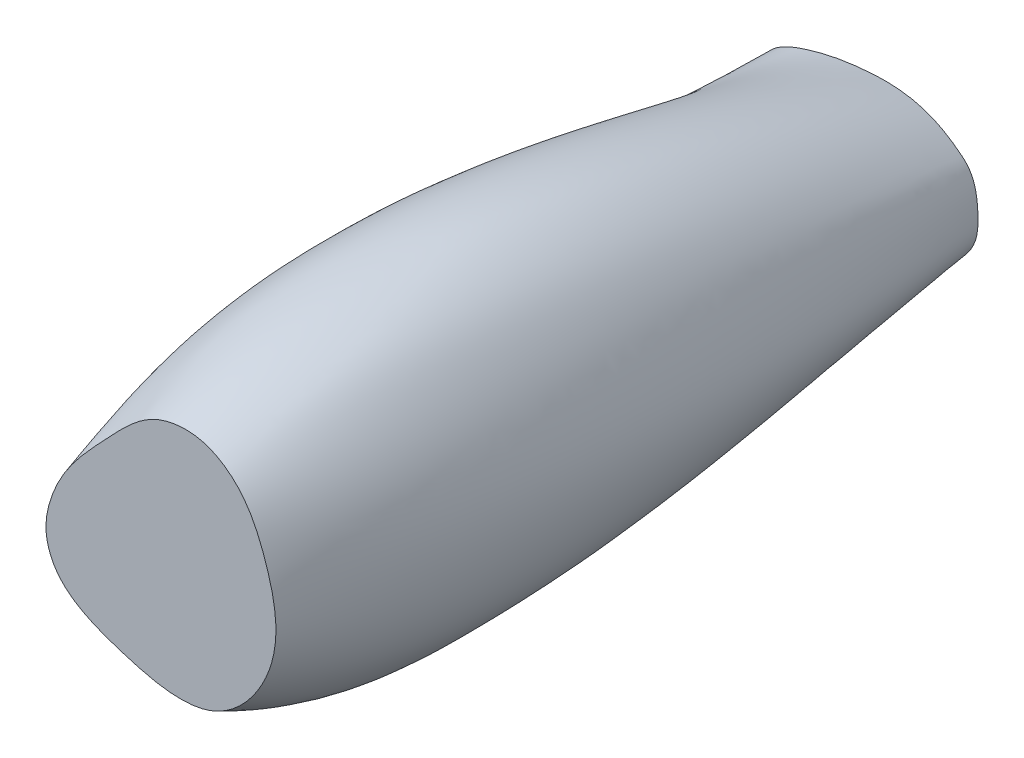
ISO-10303-21;
HEADER;
FILE_DESCRIPTION(('STEP AP214'),'2;1');
FILE_NAME('part.step','',(''),(''),'','','');
FILE_SCHEMA(('AUTOMOTIVE_DESIGN { 1 0 10303 214 1 1 1 1 }'));
ENDSEC;
DATA;
#1=APPLICATION_CONTEXT('core data for automotive mechanical design processes');
#2=APPLICATION_PROTOCOL_DEFINITION('international standard','automotive_design',2000,#1);
#3=PRODUCT_CONTEXT('',#1,'mechanical');
#4=PRODUCT('Part','Part','',(#3));
#5=PRODUCT_RELATED_PRODUCT_CATEGORY('part','',(#4));
#6=PRODUCT_DEFINITION_FORMATION('','',#4);
#7=PRODUCT_DEFINITION_CONTEXT('part definition',#1,'design');
#8=PRODUCT_DEFINITION('design','',#6,#7);
#9=PRODUCT_DEFINITION_SHAPE('','',#8);
#10=(LENGTH_UNIT() NAMED_UNIT(*) SI_UNIT(.MILLI.,.METRE.));
#11=(NAMED_UNIT(*) PLANE_ANGLE_UNIT() SI_UNIT($,.RADIAN.));
#12=(NAMED_UNIT(*) SI_UNIT($,.STERADIAN.) SOLID_ANGLE_UNIT());
#13=UNCERTAINTY_MEASURE_WITH_UNIT(LENGTH_MEASURE(1.E-05),#10,'distance_accuracy_value','');
#14=(GEOMETRIC_REPRESENTATION_CONTEXT(3) GLOBAL_UNCERTAINTY_ASSIGNED_CONTEXT((#13)) GLOBAL_UNIT_ASSIGNED_CONTEXT((#10,
#11,#12)) REPRESENTATION_CONTEXT('',''));
#15=CARTESIAN_POINT('',(0.,0.,0.));
#16=DIRECTION('',(0.,0.,1.));
#17=DIRECTION('',(1.,0.,0.));
#18=AXIS2_PLACEMENT_3D('',#15,#16,#17);
#19=CARTESIAN_POINT('',(-0.588159927287764,-20.8373353458368,-220.));
#20=DIRECTION('',(0.,0.,-1.));
#21=DIRECTION('',(-1.,0.,0.));
#22=AXIS2_PLACEMENT_3D('',#19,#20,#21);
#23=PLANE('',#22);
#24=CARTESIAN_POINT('',(1.49897216730845,23.0872771971501,-220.));
#25=CARTESIAN_POINT('',(-3.15219574899655,22.8190547733143,-220.));
#26=CARTESIAN_POINT('',(-10.9663797197799,21.7891948425807,-220.));
#27=CARTESIAN_POINT('',(-21.9882533955402,18.7077967195995,-220.));
#28=CARTESIAN_POINT('',(-30.8752869264219,14.8899464483007,-220.));
#29=CARTESIAN_POINT('',(-34.8206517873676,6.42814960432633,-220.));
#30=CARTESIAN_POINT('',(-34.1625838646697,-1.90978093792897,-220.));
#31=CARTESIAN_POINT('',(-30.9464178446988,-11.1495820783548,-220.));
#32=CARTESIAN_POINT('',(-25.3643393653193,-17.2308065356574,-220.));
#33=CARTESIAN_POINT('',(-18.3147493423369,-20.3368629306622,-220.));
#34=CARTESIAN_POINT('',(-10.5301895552438,-20.7697819109902,-220.));
#35=CARTESIAN_POINT('',(-0.228182351721812,-20.8621782044685,-220.));
#36=CARTESIAN_POINT('',(9.77284051787086,-20.8237023343144,-220.));
#37=CARTESIAN_POINT('',(19.9820341631392,-20.0812007859628,-220.));
#38=CARTESIAN_POINT('',(28.6962995382988,-15.1573119958422,-220.));
#39=CARTESIAN_POINT('',(34.8498075776385,-6.90526159101365,-220.));
#40=CARTESIAN_POINT('',(35.0718806448064,2.84997327578307,-220.));
#41=CARTESIAN_POINT('',(33.9040750654409,11.4761864353116,-220.));
#42=CARTESIAN_POINT('',(26.9725499998966,17.1396062646687,-220.));
#43=CARTESIAN_POINT('',(19.6354665746085,21.477745015482,-220.));
#44=CARTESIAN_POINT('',(10.1885517817876,23.3362651358272,-220.));
#45=CARTESIAN_POINT('',(4.08564928264427,23.2364450659609,-220.));
#46=CARTESIAN_POINT('',(1.49897216730845,23.0872771971501,-220.));
#47=B_SPLINE_CURVE_WITH_KNOTS('',3,(#24,#25,#26,#27,#28,#29,#30,#31,#32,#33,#34,#35,#36,#37,#38,
#39,#40,#41,#42,#43,#44,#45,#46),.UNSPECIFIED.,.T.,.F.,(4,1,1,1,1,1,1,1,1,1,1,1,1,1,1,1,1,1,1,1,
4),(0.,0.0751029856081616,0.126004690762449,0.187242602803573,0.221092039776855,
0.269463463900475,0.31834900126443,0.378086915049566,0.395241695832452,0.441830967213513,
0.501670279994639,0.562437268472987,0.603570590164302,0.665276965984978,0.718409253117008,
0.760346311871737,0.821216740625195,0.847665222154452,0.90138085035338,0.958232603582208,1.),.UNSPECIFIED.);
#48=CARTESIAN_POINT('',(1.49897216730845,23.0872771971501,-220.));
#49=VERTEX_POINT('',#48);
#50=EDGE_CURVE('E11',#49,#49,#47,.T.);
#51=ORIENTED_EDGE('',*,*,#50,.F.);
#52=EDGE_LOOP('',(#51));
#53=FACE_BOUND('',#52,.T.);
#54=ADVANCED_FACE('F221',(#53),#23,.T.);
#55=CARTESIAN_POINT('',(2.20457977939274,36.9553228945196,0.));
#56=DIRECTION('',(0.,0.,-1.));
#57=DIRECTION('',(-1.,0.,0.));
#58=AXIS2_PLACEMENT_3D('',#55,#56,#57);
#59=PLANE('',#58);
#60=CARTESIAN_POINT('',(-5.2502914069956,-36.8529630721787,0.));
#61=CARTESIAN_POINT('',(0.309349675782508,-37.8816983026442,0.));
#62=CARTESIAN_POINT('',(13.9597455047283,-38.3448438149647,0.));
#63=CARTESIAN_POINT('',(28.5906009023533,-23.7974341770628,0.));
#64=CARTESIAN_POINT('',(33.4405033532179,-7.86303513934624,0.));
#65=CARTESIAN_POINT('',(32.1954010942843,4.89739350571201,0.));
#66=CARTESIAN_POINT('',(28.9838570859017,15.5554135455331,0.));
#67=CARTESIAN_POINT('',(24.5027188488703,25.8135930036297,0.));
#68=CARTESIAN_POINT('',(17.3856959618233,33.1562228645843,0.));
#69=CARTESIAN_POINT('',(7.48333104176243,37.9860881031292,0.));
#70=CARTESIAN_POINT('',(-5.15763610703121,36.5435855733442,0.));
#71=CARTESIAN_POINT('',(-14.5298136437512,28.7151895404954,0.));
#72=CARTESIAN_POINT('',(-23.4556923594998,19.1456117526131,0.));
#73=CARTESIAN_POINT('',(-32.6284946271597,9.52275497463379,0.));
#74=CARTESIAN_POINT('',(-38.8040103904256,-2.68445600377233,0.));
#75=CARTESIAN_POINT('',(-40.8730679500826,-13.4214089352705,0.));
#76=CARTESIAN_POINT('',(-36.8364693509132,-23.5940769342649,0.));
#77=CARTESIAN_POINT('',(-27.2949651818519,-30.3798383718283,0.));
#78=CARTESIAN_POINT('',(-16.2538424208862,-34.0322182364438,0.));
#79=CARTESIAN_POINT('',(-8.68028151071838,-36.2182905083728,0.));
#80=CARTESIAN_POINT('',(-5.2502914069956,-36.8529630721787,0.));
#81=B_SPLINE_CURVE_WITH_KNOTS('',3,(#60,#61,#62,#63,#64,#65,#66,#67,#68,#69,#70,#71,#72,#73,#74,
#75,#76,#77,#78,#79,#80),.UNSPECIFIED.,.T.,.F.,(4,1,1,1,1,1,1,1,1,1,1,1,1,1,1,1,1,1,4),(0.,
0.0736214257322989,0.169555869593377,0.24545458366792,0.287341618234984,0.336556856863484,
0.392148843891768,0.432954260940746,0.468579173743589,0.534489875158813,0.585767834056427,
0.626672929571137,0.707682573519489,0.759138648676126,0.805679676472343,0.847138914786217,
0.895447636569129,0.954579664779805,1.),.UNSPECIFIED.);
#82=CARTESIAN_POINT('',(-5.2502914069956,-36.8529630721787,0.));
#83=VERTEX_POINT('',#82);
#84=EDGE_CURVE('E231',#83,#83,#81,.T.);
#85=ORIENTED_EDGE('',*,*,#84,.T.);
#86=EDGE_LOOP('',(#85));
#87=FACE_BOUND('',#86,.T.);
#88=ADVANCED_FACE('F260',(#87),#59,.F.);
#89=CARTESIAN_POINT('',(-22.0206341022484,20.7059933631042,0.));
#90=CARTESIAN_POINT('',(-24.9385900685454,32.5644760542962,-23.4805545244831));
#91=CARTESIAN_POINT('',(-24.5905098412194,46.5492473788973,-95.4289120310754));
#92=CARTESIAN_POINT('',(-12.9087571502759,33.8336225804843,-170.14722119115));
#93=CARTESIAN_POINT('',(-3.97588472484428,22.6097131523864,-220.));
#94=CARTESIAN_POINT('',(-21.207241651111,21.5711806043139,0.));
#95=CARTESIAN_POINT('',(-23.8730929870936,33.6231324440316,-23.4912473845041));
#96=CARTESIAN_POINT('',(-23.2095457418706,47.6765126170158,-95.41508729655));
#97=CARTESIAN_POINT('',(-11.743097541658,34.3910612132038,-170.157914051171));
#98=CARTESIAN_POINT('',(-3.01191416576798,22.7228110509813,-220.));
#99=CARTESIAN_POINT('',(-19.5869378509116,23.3014550215752,0.));
#100=CARTESIAN_POINT('',(-21.6699663553708,35.653062159212,-23.5130167713898));
#101=CARTESIAN_POINT('',(-20.2786422475475,49.7343373627524,-95.3869417869404));
#102=CARTESIAN_POINT('',(-9.331493116039,35.3972979701985,-170.179683438056));
#103=CARTESIAN_POINT('',(-1.07938315053454,22.9179306619975,-220.));
#104=CARTESIAN_POINT('',(-17.1364346024358,25.869516287455,0.));
#105=CARTESIAN_POINT('',(-18.1597836642637,38.3842624674942,-23.5431703581061));
#106=CARTESIAN_POINT('',(-15.4708280187413,52.1716734046863,-95.3479563957045));
#107=CARTESIAN_POINT('',(-5.5193327277089,36.5519334851259,-170.209837024773));
#108=CARTESIAN_POINT('',(1.82428338178402,23.1209901407397,-220.));
#109=CARTESIAN_POINT('',(-14.6070539179327,28.3769377766475,0.));
#110=CARTESIAN_POINT('',(-14.4536905550372,40.7494272633524,-23.567169031108));
#111=CARTESIAN_POINT('',(-10.3467944487845,53.887264868015,-95.3169286554597));
#112=CARTESIAN_POINT('',(-1.56457366302173,37.3188522588399,-170.233835697775));
#113=CARTESIAN_POINT('',(4.72661026116035,23.2310840385875,-220.));
#114=CARTESIAN_POINT('',(-11.9497188644468,30.7827855463752,0.));
#115=CARTESIAN_POINT('',(-10.5621647191511,42.7371296361792,-23.5831290685178));
#116=CARTESIAN_POINT('',(-4.99570166167923,54.9036570869547,-95.2962940189093));
#117=CARTESIAN_POINT('',(2.48957263896279,37.6868884231948,-170.249795735185));
#118=CARTESIAN_POINT('',(7.62789022905679,23.2074213252265,-220.));
#119=CARTESIAN_POINT('',(-9.58180639070632,32.5911825454385,0.));
#120=CARTESIAN_POINT('',(-7.16851701193403,44.0521740100663,-23.5884481333636));
#121=CARTESIAN_POINT('',(-0.417023828440446,55.2530623956062,-95.2894170319045));
#122=CARTESIAN_POINT('',(5.91836966257948,37.6856444795928,-170.25511480003));
#123=CARTESIAN_POINT('',(10.0485232417851,23.0413885477663,-220.));
#124=CARTESIAN_POINT('',(-7.57287929788633,33.8610890516728,0.));
#125=CARTESIAN_POINT('',(-4.38073063477421,44.8419668367052,-23.5878602347802));
#126=CARTESIAN_POINT('',(3.24832469348306,55.1867236010912,-95.2901771224532));
#127=CARTESIAN_POINT('',(8.6551249391984,37.4717094515082,-170.254526901447));
#128=CARTESIAN_POINT('',(11.9809041345079,22.8057029177434,-220.));
#129=CARTESIAN_POINT('',(-6.00065260861702,34.7081995889718,0.));
#130=CARTESIAN_POINT('',(-2.25826443257981,45.2817375428201,-23.5849217935543));
#131=CARTESIAN_POINT('',(5.97618868733869,54.9403034050657,-95.2939762154729));
#132=CARTESIAN_POINT('',(10.691161021627,37.1934109668931,-170.251588460221));
#133=CARTESIAN_POINT('',(13.4234855535523,22.5757097401223,-220.));
#134=CARTESIAN_POINT('',(-4.35466173695289,35.4330769880257,0.));
#135=CARTESIAN_POINT('',(-0.107273581445392,45.5535953470915,-23.5795769237701));
#136=CARTESIAN_POINT('',(8.66414027168808,54.4866555914315,-95.3008865655284));
#137=CARTESIAN_POINT('',(12.6989817266587,36.7920029286415,-170.246243590437));
#138=CARTESIAN_POINT('',(14.8547212303315,22.2906883563209,-220.));
#139=CARTESIAN_POINT('',(-2.64663747045134,36.0309005855838,0.));
#140=CARTESIAN_POINT('',(2.05902342885231,45.6419901159658,-23.5715030900374));
#141=CARTESIAN_POINT('',(11.2990066818779,53.7983121015305,-95.3113251766894));
#142=CARTESIAN_POINT('',(14.6709502233534,36.2537460906273,-170.238169756704));
#143=CARTESIAN_POINT('',(16.2712527199284,21.9485345486541,-220.));
#144=CARTESIAN_POINT('',(-0.888310596669772,36.4968497183955,0.));
#145=CARTESIAN_POINT('',(4.23136274381245,45.5596002432675,-23.5610457219308));
#146=CARTESIAN_POINT('',(13.8758875799485,52.908550606828,-95.3248454451323));
#147=CARTESIAN_POINT('',(16.6033841929703,35.5931298308166,-170.227712388598));
#148=CARTESIAN_POINT('',(17.6697215774264,21.5471440994368,-220.));
#149=CARTESIAN_POINT('',(1.5026346493834,36.9374420256805,0.));
#150=CARTESIAN_POINT('',(7.12036944986427,45.2313217912889,-23.544223401547));
#151=CARTESIAN_POINT('',(17.2274410557912,51.4794249249177,-95.3465949221624));
#152=CARTESIAN_POINT('',(19.1212837867172,34.5594386327652,-170.210890068214));
#153=CARTESIAN_POINT('',(19.5040061544553,20.9296172880581,-220.));
#154=CARTESIAN_POINT('',(4.53996999254141,37.1403440599126,0.));
#155=CARTESIAN_POINT('',(10.6920822668918,44.454163891892,-23.5193098572396));
#156=CARTESIAN_POINT('',(21.252973081393,49.3408035806858,-95.3788054940259));
#157=CARTESIAN_POINT('',(22.1509298267225,33.025285906072,-170.185976523906));
#158=CARTESIAN_POINT('',(21.728241332358,19.9970270811271,-220.));
#159=CARTESIAN_POINT('',(8.15544859067315,36.8022189497486,0.));
#160=CARTESIAN_POINT('',(14.8135198143268,42.9515635356624,-23.484549381293));
#161=CARTESIAN_POINT('',(25.7486368869978,46.2855603297147,-95.4237471046892));
#162=CARTESIAN_POINT('',(25.5712180706899,30.8441031063658,-170.15121604796));
#163=CARTESIAN_POINT('',(24.2919959751983,18.6410283058188,-220.));
#164=CARTESIAN_POINT('',(11.0397167466429,35.9995247125174,0.));
#165=CARTESIAN_POINT('',(17.9998665081216,41.1916621118281,-23.4510293140569));
#166=CARTESIAN_POINT('',(29.1198555425756,43.3171087604394,-95.4670849983777));
#167=CARTESIAN_POINT('',(28.2056887123179,28.7542349806693,-170.117695980724));
#168=CARTESIAN_POINT('',(26.3484500529398,17.3433840157774,-220.));
#169=CARTESIAN_POINT('',(13.2350295713747,35.0688066115387,0.));
#170=CARTESIAN_POINT('',(20.3604845071628,39.495898001429,-23.4220643147077));
#171=CARTESIAN_POINT('',(31.5548793649733,40.6952785523175,-95.504533672142));
#172=CARTESIAN_POINT('',(30.1708034394427,26.9271532007385,-170.088730981374));
#173=CARTESIAN_POINT('',(27.9505079697942,16.2156894105033,-220.));
#174=CARTESIAN_POINT('',(14.8199879074142,34.2398548383652,0.));
#175=CARTESIAN_POINT('',(22.0441156891037,38.1019964142934,-23.3994103732466));
#176=CARTESIAN_POINT('',(33.2742304140808,38.6359641536527,-95.5338228170518));
#177=CARTESIAN_POINT('',(31.5870122854544,25.4975094787177,-170.066077039913));
#178=CARTESIAN_POINT('',(29.1343328019403,15.3331244350015,-220.));
#179=CARTESIAN_POINT('',(16.3379445284567,33.2933580259097,0.));
#180=CARTESIAN_POINT('',(23.6521296233667,36.6104561638062,-23.3767770813949));
#181=CARTESIAN_POINT('',(34.9114090298689,36.5149173928393,-95.5630852642055));
#182=CARTESIAN_POINT('',(32.9392655397523,24.0126017318754,-170.043443748061));
#183=CARTESIAN_POINT('',(30.2686484030351,14.3965763780135,-220.));
#184=CARTESIAN_POINT('',(17.7834034885676,32.2393151477318,0.));
#185=CARTESIAN_POINT('',(25.1933859237596,35.0400233002965,-23.3551765637841));
#186=CARTESIAN_POINT('',(36.4832273247588,34.3548386582362,-95.5910124437433));
#187=CARTESIAN_POINT('',(34.2096116743025,22.4703999325841,-170.021843230451));
#188=CARTESIAN_POINT('',(31.3077421143819,13.3848800961632,-220.));
#189=CARTESIAN_POINT('',(19.1508688418121,31.0877251773909,0.));
#190=CARTESIAN_POINT('',(26.6769513334988,33.4097986628211,-23.3356537620625));
#191=CARTESIAN_POINT('',(38.0065221441037,32.178480770916,-95.6162533568821));
#192=CARTESIAN_POINT('',(35.3790704181175,20.8670694001276,-170.002320428729));
#193=CARTESIAN_POINT('',(32.2040474687401,12.2736312833506,-220.));
#194=CARTESIAN_POINT('',(20.4390265543345,29.8477033279797,0.));
#195=CARTESIAN_POINT('',(28.1022811998596,31.7229622677222,-23.3185983746104));
#196=CARTESIAN_POINT('',(39.4765910643196,29.9783630593142,-95.6383041649253));
#197=CARTESIAN_POINT('',(36.4311794145777,19.1930462909403,-169.985265041277));
#198=CARTESIAN_POINT('',(32.9323738764115,11.0528293628067,-220.));
#199=CARTESIAN_POINT('',(21.6465625922791,28.5283648125904,0.));
#200=CARTESIAN_POINT('',(29.4635514761063,29.9794428664761,-23.3034554952147));
#201=CARTESIAN_POINT('',(40.8877917507024,27.7462509925242,-95.6578823027842));
#202=CARTESIAN_POINT('',(37.3770049094122,17.4564594288486,-169.970122161882));
#203=CARTESIAN_POINT('',(33.516742742238,9.74388965614918,-220.));
#204=CARTESIAN_POINT('',(23.1438609015758,26.6757906086725,0.));
#205=CARTESIAN_POINT('',(31.1869747748305,27.5818278138964,-23.2852639819922));
#206=CARTESIAN_POINT('',(42.688959611731,24.7200530229487,-95.6814020010149));
#207=CARTESIAN_POINT('',(38.506928489482,15.064042824686,-169.951930648659));
#208=CARTESIAN_POINT('',(34.1237914735531,7.89911312485681,-220.));
#209=CARTESIAN_POINT('',(24.4641533361392,24.7014811865138,0.));
#210=CARTESIAN_POINT('',(32.7633722340426,25.0778728415353,-23.2690684412923));
#211=CARTESIAN_POINT('',(44.3665178927186,21.6074978406987,-95.702341118354));
#212=CARTESIAN_POINT('',(39.4575754429623,12.5708847388241,-169.935735107959));
#213=CARTESIAN_POINT('',(34.5054581495188,5.94099903244704,-220.));
#214=CARTESIAN_POINT('',(25.6304764492327,22.6355491632853,0.));
#215=CARTESIAN_POINT('',(34.1828480990624,22.4736496835078,-23.2540164579161));
#216=CARTESIAN_POINT('',(45.8830147635864,18.3937016019702,-95.721801737295));
#217=CARTESIAN_POINT('',(40.2510781416777,10.0049619420171,-169.920683124583));
#218=CARTESIAN_POINT('',(34.7328215131557,3.9325175510492,-220.));
#219=CARTESIAN_POINT('',(26.7055038985331,20.5170806393108,0.));
#220=CARTESIAN_POINT('',(35.4919124481923,19.8089354618617,-23.2398715087882));
#221=CARTESIAN_POINT('',(47.2673645502743,15.1189062943755,-95.7400896571018));
#222=CARTESIAN_POINT('',(40.9361879577514,7.40518912960893,-169.906538175455));
#223=CARTESIAN_POINT('',(34.8719171628717,1.91146114093173,-220.000000000001));
#224=CARTESIAN_POINT('',(27.8993911227714,17.7865113578824,0.));
#225=CARTESIAN_POINT('',(36.9051955074468,16.375585228922,-23.2232453175106));
#226=CARTESIAN_POINT('',(48.7026601739071,10.9229283778579,-95.7615855599875));
#227=CARTESIAN_POINT('',(41.6094134464338,4.12495512920619,-169.889911984177));
#228=CARTESIAN_POINT('',(34.9557180312521,-0.589433791691412,-219.999999999999));
#229=CARTESIAN_POINT('',(28.9481848611191,14.9951700676869,0.));
#230=CARTESIAN_POINT('',(38.0150532579884,12.8403924907371,-23.2108120621354));
#231=CARTESIAN_POINT('',(49.6361596237136,6.6076169300552,-95.7776604412178));
#232=CARTESIAN_POINT('',(41.9289010730897,0.833011774290992,-169.877478728803));
#233=CARTESIAN_POINT('',(34.818956583771,-3.01590100698227,-220.000000000001));
#234=CARTESIAN_POINT('',(29.725700196049,12.7478243191955,0.));
#235=CARTESIAN_POINT('',(38.71456044079,9.97242504504647,-23.2055870436848));
#236=CARTESIAN_POINT('',(50.0150172753577,3.10321953984292,-95.7844158362037));
#237=CARTESIAN_POINT('',(41.8893739615397,-1.79078401135085,-169.872253710352));
#238=CARTESIAN_POINT('',(34.4879204771734,-4.89698926540046,-220.));
#239=CARTESIAN_POINT('',(30.4547387985013,10.488508366061,0.));
#240=CARTESIAN_POINT('',(39.2824180448981,7.07941269395447,-23.2037261275516));
#241=CARTESIAN_POINT('',(50.1409175966807,-0.428120768059226,-95.7868218034998));
#242=CARTESIAN_POINT('',(41.6365104533426,-4.40092468794153,-169.870392794218));
#243=CARTESIAN_POINT('',(33.9858774111682,-6.73199770678295,-220.));
#244=CARTESIAN_POINT('',(31.2611488744612,7.63731605265019,0.));
#245=CARTESIAN_POINT('',(39.7602423361075,3.42131754379,-23.2080377597091));
#246=CARTESIAN_POINT('',(49.8659668620012,-4.87320151382391,-95.7812473201691));
#247=CARTESIAN_POINT('',(40.9155305308992,-7.62227038257367,-169.874704426376));
#248=CARTESIAN_POINT('',(32.9940811666487,-8.92806583689532,-220.));
#249=CARTESIAN_POINT('',(32.0319845443462,4.16501006325165,0.));
#250=CARTESIAN_POINT('',(39.9826216035997,-1.01805801545545,-23.2210064466318));
#251=CARTESIAN_POINT('',(48.9538808488315,-10.2034628511734,-95.7644801827053));
#252=CARTESIAN_POINT('',(39.5242688481809,-11.3769061540282,-169.887673113298));
#253=CARTESIAN_POINT('',(31.344455411218,-11.3732621446074,-220.));
#254=CARTESIAN_POINT('',(32.5674998069128,0.632507018807832,0.));
#255=CARTESIAN_POINT('',(39.870986582102,-5.49018140762836,-23.2400961011056));
#256=CARTESIAN_POINT('',(47.5701369771651,-15.4748691567223,-95.7397992830433));
#257=CARTESIAN_POINT('',(37.7164582112891,-14.9750932203836,-169.906762767772));
#258=CARTESIAN_POINT('',(29.3357072506934,-13.594860700325,-220.));
#259=CARTESIAN_POINT('',(32.8183188444259,-2.92822133360603,0.));
#260=CARTESIAN_POINT('',(39.4405499257545,-9.96075029036307,-23.2635822357107));
#261=CARTESIAN_POINT('',(45.8401133551426,-20.6506378737666,-95.7094342006131));
#262=CARTESIAN_POINT('',(35.6208475202973,-18.3800250774247,-169.930248902377));
#263=CARTESIAN_POINT('',(27.0887652362402,-15.5571335141985,-220.));
#264=CARTESIAN_POINT('',(32.7241628630671,-6.48558697981288,0.));
#265=CARTESIAN_POINT('',(38.658523936472,-14.3911265127956,-23.2918080413375));
#266=CARTESIAN_POINT('',(43.7862494357921,-25.685258821694,-95.6729412259756));
#267=CARTESIAN_POINT('',(33.2792393915879,-21.5551279435671,-169.958474708004));
#268=CARTESIAN_POINT('',(24.655236045741,-17.2315891259701,-220.));
#269=CARTESIAN_POINT('',(32.2532344023482,-10.0114266391906,0.));
#270=CARTESIAN_POINT('',(37.5014233697683,-18.7454988801799,-23.3264344950341));
#271=CARTESIAN_POINT('',(41.4065784349972,-30.5336374269306,-95.6281728918741));
#272=CARTESIAN_POINT('',(30.7048981033921,-24.4611111858543,-169.993101161701));
#273=CARTESIAN_POINT('',(22.058446502784,-18.5848450977022,-220.));
#274=CARTESIAN_POINT('',(31.4269086321696,-13.4844139493744,0.));
#275=CARTESIAN_POINT('',(35.9687372877455,-22.9875802503185,-23.3690873522325));
#276=CARTESIAN_POINT('',(38.6785748589858,-35.1432343584151,-95.5730272688737));
#277=CARTESIAN_POINT('',(27.9053117685088,-27.0615483735552,-170.035754018899));
#278=CARTESIAN_POINT('',(19.3317703533145,-19.5953661342295,-220.));
#279=CARTESIAN_POINT('',(30.2532286789992,-16.883015636577,0.));
#280=CARTESIAN_POINT('',(34.0573460801498,-27.0875373258712,-23.4215633632217));
#281=CARTESIAN_POINT('',(35.591158459962,-39.4709557022631,-95.5051813493107));
#282=CARTESIAN_POINT('',(24.8908412334168,-29.3097632722301,-170.088230029888));
#283=CARTESIAN_POINT('',(16.5034714088997,-20.2163545561153,-220.));
#284=CARTESIAN_POINT('',(28.9982838179134,-19.6330799329371,0.));
#285=CARTESIAN_POINT('',(32.141000595494,-30.3401796421407,-23.4717683840726));
#286=CARTESIAN_POINT('',(32.6907141909767,-42.7884238651735,-95.4402715792636));
#287=CARTESIAN_POINT('',(22.2035626003081,-30.9055816992539,-170.13843505074));
#288=CARTESIAN_POINT('',(14.0921268251346,-20.4811830186069,-220.));
#289=CARTESIAN_POINT('',(27.8331972611706,-21.7753571834187,0.));
#290=CARTESIAN_POINT('',(30.4451421352858,-32.8536893082058,-23.5145534218415));
#291=CARTESIAN_POINT('',(30.2379368413343,-45.3163362041835,-95.3849550607964));
#292=CARTESIAN_POINT('',(19.990003044632,-32.0770688272663,-170.181220088508));
#293=CARTESIAN_POINT('',(12.1504886251899,-20.6104264620094,-220.));
#294=CARTESIAN_POINT('',(26.8810481994053,-23.3477931929753,0.));
#295=CARTESIAN_POINT('',(29.1064303465445,-34.7025254288274,-23.547986517123));
#296=CARTESIAN_POINT('',(28.3612236044555,-47.1765342996996,-95.3417296126264));
#297=CARTESIAN_POINT('',(18.3139550911087,-32.92367414296,-170.21465318379));
#298=CARTESIAN_POINT('',(10.6923353162517,-20.6795162641743,-220.));
#299=CARTESIAN_POINT('',(25.8527961831607,-24.8805724392263,0.));
#300=CARTESIAN_POINT('',(27.7115270274629,-36.5193000094868,-23.5827480076023));
#301=CARTESIAN_POINT('',(26.4679718815933,-49.0201730844404,-95.2967866902796));
#302=CARTESIAN_POINT('',(16.634072209236,-33.755071829243,-170.249414674269));
#303=CARTESIAN_POINT('',(9.2366139558203,-20.7342301688605,-220.));
#304=CARTESIAN_POINT('',(24.7512365756876,-26.3646226486057,0.));
#305=CARTESIAN_POINT('',(26.2639943121073,-38.2975079256347,-23.6188370195448));
#306=CARTESIAN_POINT('',(24.561859541077,-50.8458368201416,-95.2501274234036));
#307=CARTESIAN_POINT('',(14.9517372119747,-34.5716393463771,-170.285503686211));
#308=CARTESIAN_POINT('',(7.78285092548882,-20.7758197797194,-220.));
#309=CARTESIAN_POINT('',(23.5791647402371,-27.7908715475478,0.));
#310=CARTESIAN_POINT('',(24.7451086865381,-40.0037563699739,-23.6548925176657));
#311=CARTESIAN_POINT('',(22.5983607931065,-52.5942216181358,-95.2035114863456));
#312=CARTESIAN_POINT('',(13.2460472642802,-35.3468664718769,-170.321559184332));
#313=CARTESIAN_POINT('',(6.33057260685036,-20.8055367004023,-220.));
#314=CARTESIAN_POINT('',(22.339342419722,-29.151591351814,0.));
#315=CARTESIAN_POINT('',(23.1437525241896,-41.6142902205696,-23.6896005987294));
#316=CARTESIAN_POINT('',(20.5493955527329,-54.2248524076329,-95.1586376167123));
#317=CARTESIAN_POINT('',(11.5040042211567,-36.0633086476396,-170.356267265396));
#318=CARTESIAN_POINT('',(4.87971996517257,-20.8251189924191,-220.));
#319=CARTESIAN_POINT('',(21.0345313570549,-30.4390542771655,0.));
#320=CARTESIAN_POINT('',(21.4431166368208,-43.0987242070445,-23.7210532543757));
#321=CARTESIAN_POINT('',(18.3744985979745,-55.6828101098657,-95.1179726670561));
#322=CARTESIAN_POINT('',(9.70691837593292,-36.6968911671207,-170.387719921042));
#323=CARTESIAN_POINT('',(3.43023396572309,-20.8363047172797,-220.));
#324=CARTESIAN_POINT('',(19.667353414719,-31.6444736768562,0.));
#325=CARTESIAN_POINT('',(19.6363271084964,-44.4373115998447,-23.747708221975));
#326=CARTESIAN_POINT('',(16.054789880333,-56.9373378604403,-95.0835106194731));
#327=CARTESIAN_POINT('',(7.84601639464599,-37.2349086092426,-170.414374888642));
#328=CARTESIAN_POINT('',(1.98188734394342,-20.840869190953,-220.));
#329=CARTESIAN_POINT('',(18.2404304551973,-32.7590629041396,0.));
#330=CARTESIAN_POINT('',(17.7422740611446,-45.6344784413282,-23.7696651470124));
#331=CARTESIAN_POINT('',(13.6271691293989,-58.0097710556383,-95.0551226429127));
#332=CARTESIAN_POINT('',(5.93828898119642,-37.6888283248403,-170.436331813679));
#333=CARTESIAN_POINT('',(0.534452835275025,-20.8405877294078,-220.));
#334=CARTESIAN_POINT('',(16.2621502969555,-34.1141573060539,0.));
#335=CARTESIAN_POINT('',(15.1145281591933,-47.0414877317941,-23.7924865052197));
#336=CARTESIAN_POINT('',(10.2710252171233,-59.2086876682973,-95.0256170458971));
#337=CARTESIAN_POINT('',(3.34341613651398,-38.1889747705133,-170.459153171887));
#338=CARTESIAN_POINT('',(-1.39451773706347,-20.8353878641325,-220.));
#339=CARTESIAN_POINT('',(13.6547268463199,-35.5437586102261,0.));
#340=CARTESIAN_POINT('',(11.6856822962721,-48.4524032417934,-23.8098697780532));
#341=CARTESIAN_POINT('',(5.94467374795812,-60.3141440527019,-95.0031423168129));
#342=CARTESIAN_POINT('',(0.0462121732640287,-38.6385046239948,-170.47653644472));
#343=CARTESIAN_POINT('',(-3.80447833819218,-20.8229106835283,-220.));
#344=CARTESIAN_POINT('',(10.3283778317467,-36.7573122635234,0.));
#345=CARTESIAN_POINT('',(7.41613751703546,-49.5884303517515,-23.8146021236951));
#346=CARTESIAN_POINT('',(0.680763835840174,-61.1133865400913,-94.9970238955436));
#347=CARTESIAN_POINT('',(-3.93688919702146,-38.9419127850031,-170.481268790362));
#348=CARTESIAN_POINT('',(-6.70116223933865,-20.7875359134007,-220.));
#349=CARTESIAN_POINT('',(7.4209354462606,-37.331673803456,0.));
#350=CARTESIAN_POINT('',(3.75853974518644,-50.0893079111247,-23.8062461580853));
#351=CARTESIAN_POINT('',(-3.74211341042253,-61.402986841812,-95.0078272733148));
#352=CARTESIAN_POINT('',(-7.27053530959373,-39.0254186846515,-170.472912824752));
#353=CARTESIAN_POINT('',(-9.12267713590965,-20.7358399637462,-220.));
#354=CARTESIAN_POINT('',(5.04521819343564,-37.5707380917166,0.));
#355=CARTESIAN_POINT('',(0.801667275427661,-50.2552426086747,-23.7936699036839));
#356=CARTESIAN_POINT('',(-7.28253898515198,-61.422047006756,-95.0240870371271));
#357=CARTESIAN_POINT('',(-9.94059903557322,-38.9919567633803,-170.460336570351));
#358=CARTESIAN_POINT('',(-11.0681812730657,-20.675809323775,-220.));
#359=CARTESIAN_POINT('',(2.64626475994564,-37.6725230316199,0.));
#360=CARTESIAN_POINT('',(-2.16726182816747,-50.2746018574336,-23.7774428605228));
#361=CARTESIAN_POINT('',(-10.8194840896893,-61.3080396383945,-95.0450668838094));
#362=CARTESIAN_POINT('',(-12.611068305758,-38.8960388225719,-170.444109527189));
#363=CARTESIAN_POINT('',(-13.0194449564402,-20.6046784793273,-220.));
#364=CARTESIAN_POINT('',(-0.377358528865692,-37.5604878297658,0.));
#365=CARTESIAN_POINT('',(-5.88625685195204,-50.0470062080495,-23.7525877256425));
#366=CARTESIAN_POINT('',(-15.2250209296874,-60.9335114188123,-95.0772019384765));
#367=CARTESIAN_POINT('',(-15.9415091825412,-38.6425045882767,-170.419254392309));
#368=CARTESIAN_POINT('',(-15.4602370247494,-20.4537354001065,-220.));
#369=CARTESIAN_POINT('',(-3.38824554070791,-37.1887836620415,0.));
#370=CARTESIAN_POINT('',(-9.57680464810565,-49.5320701069945,-23.7280663025013));
#371=CARTESIAN_POINT('',(-19.576524969957,-60.2497574264215,-95.108905539238));
#372=CARTESIAN_POINT('',(-19.2205022709349,-38.1340088028072,-170.394732969168));
#373=CARTESIAN_POINT('',(-17.8537919749519,-20.0916917057607,-220.));
#374=CARTESIAN_POINT('',(-5.75351853719296,-36.7669101731011,0.));
#375=CARTESIAN_POINT('',(-12.4839699411078,-48.9548106915191,-23.7113127368706));
#376=CARTESIAN_POINT('',(-23.0080611979509,-59.4754944490718,-95.1305661236605));
#377=CARTESIAN_POINT('',(-21.7940181090785,-37.5090575746585,-170.377979403537));
#378=CARTESIAN_POINT('',(-19.718590789149,-19.5982804978101,-220.));
#379=CARTESIAN_POINT('',(-8.09037338165713,-36.2734192528056,0.));
#380=CARTESIAN_POINT('',(-15.3573058683164,-48.271656549922,-23.6976949624239));
#381=CARTESIAN_POINT('',(-26.3953729652018,-58.5388051096938,-95.1481724624872));
#382=CARTESIAN_POINT('',(-24.3226779470201,-36.7184143121755,-170.364361629091));
#383=CARTESIAN_POINT('',(-21.5384314997126,-18.9435558961859,-220.));
#384=CARTESIAN_POINT('',(-10.959169633395,-35.5436279283059,0.));
#385=CARTESIAN_POINT('',(-18.8790096815803,-47.2225169804959,-23.6870295951012));
#386=CARTESIAN_POINT('',(-30.5260018067816,-57.0416711706686,-95.1619616518677));
#387=CARTESIAN_POINT('',(-27.3749957115525,-35.4078369153079,-170.353696261768));
#388=CARTESIAN_POINT('',(-23.7031486783533,-17.8216078305238,-220.));
#389=CARTESIAN_POINT('',(-14.3578853389196,-34.5420348645192,0.));
#390=CARTESIAN_POINT('',(-22.9896378074443,-45.6469842017861,-23.6838106860643));
#391=CARTESIAN_POINT('',(-35.2402372513767,-54.6537784881218,-95.1661233600362));
#392=CARTESIAN_POINT('',(-30.7803922944925,-33.3246363412317,-170.350477352731));
#393=CARTESIAN_POINT('',(-26.0440170694919,-16.0585130736875,-220.));
#394=CARTESIAN_POINT('',(-17.7487151649748,-33.4936407721866,0.));
#395=CARTESIAN_POINT('',(-26.9860794163198,-43.7915995101725,-23.6889744131577));
#396=CARTESIAN_POINT('',(-39.6647066470406,-51.6623689151788,-95.159447208279));
#397=CARTESIAN_POINT('',(-33.8988062682336,-30.7665644141251,-170.355641079824));
#398=CARTESIAN_POINT('',(-28.1178054428455,-13.9560881281156,-219.999999999999));
#399=CARTESIAN_POINT('',(-20.5573093482174,-32.54892700527,0.));
#400=CARTESIAN_POINT('',(-30.2026891009893,-41.9962131978621,-23.6963532099691));
#401=CARTESIAN_POINT('',(-43.0817810141546,-48.6876002864389,-95.14990720618));
#402=CARTESIAN_POINT('',(-36.2340876521197,-28.2876328193146,-170.363019876636));
#403=CARTESIAN_POINT('',(-29.604407174913,-11.9860564374487,-220.));
#404=CARTESIAN_POINT('',(-22.7774995967297,-31.7130018571695,0.));
#405=CARTESIAN_POINT('',(-32.6964682104799,-40.3941931632746,-23.7015135871783));
#406=CARTESIAN_POINT('',(-45.6492375202848,-46.0421712649136,-95.1432353854676));
#407=CARTESIAN_POINT('',(-37.9351334121862,-26.1329892950468,-170.368180253845));
#408=CARTESIAN_POINT('',(-30.6354973992893,-10.3211960548278,-220.));
#409=CARTESIAN_POINT('',(-24.4257334028625,-31.037941268939,0.));
#410=CARTESIAN_POINT('',(-34.5016693083076,-39.1029832887808,-23.7047772930401));
#411=CARTESIAN_POINT('',(-47.4422327399979,-43.9226512827473,-95.1390157597525));
#412=CARTESIAN_POINT('',(-39.1048537030242,-24.4340981534782,-170.371443959707));
#413=CARTESIAN_POINT('',(-31.3305099949375,-9.03461356598513,-220.));
#414=CARTESIAN_POINT('',(-26.0534919975333,-30.3067242936818,0.));
#415=CARTESIAN_POINT('',(-36.2015706056262,-37.7127923941576,-23.7070681950072));
#416=CARTESIAN_POINT('',(-49.0213999675842,-41.6597424486628,-95.1360538663531));
#417=CARTESIAN_POINT('',(-40.1312479579084,-22.6526923239913,-170.373734861674));
#418=CARTESIAN_POINT('',(-31.9480080259567,-7.71657418843234,-220.));
#419=CARTESIAN_POINT('',(-27.6577371045664,-29.5109753401647,0.));
#420=CARTESIAN_POINT('',(-37.7627310407317,-36.2159949590845,-23.7078057269939));
#421=CARTESIAN_POINT('',(-50.3197235991911,-39.2485287619372,-95.1351003156754));
#422=CARTESIAN_POINT('',(-40.9851057252972,-20.788073212689,-170.374472393661));
#423=CARTESIAN_POINT('',(-32.4912991314146,-6.36909272057151,-220.));
#424=CARTESIAN_POINT('',(-29.2354304477857,-28.6423188171545,0.));
#425=CARTESIAN_POINT('',(-39.1472255743245,-34.6039070108481,-23.7061019378212));
#426=CARTESIAN_POINT('',(-51.2605404703953,-36.6816943280019,-95.1373031344678));
#427=CARTESIAN_POINT('',(-41.6327325760535,-18.8384837732816,-170.372768604488));
#428=CARTESIAN_POINT('',(-32.9636909503792,-4.99418396080475,-220.));
#429=CARTESIAN_POINT('',(-30.768529249783,-27.6931093231839,0.));
#430=CARTESIAN_POINT('',(-40.3155150714331,-32.8698175767014,-23.7003001921823));
#431=CARTESIAN_POINT('',(-51.784312916136,-33.9550413973199,-95.144804176573));
#432=CARTESIAN_POINT('',(-42.0501934922477,-16.8042445308476,-170.366966858849));
#433=CARTESIAN_POINT('',(-33.3705468810049,-3.5947497544033,-220.));
#434=CARTESIAN_POINT('',(-32.2389907331495,-26.6557014567856,0.));
#435=CARTESIAN_POINT('',(-41.2878243658751,-31.0309222901199,-23.6897318798778));
#436=CARTESIAN_POINT('',(-51.9596372515318,-31.1160374265626,-95.1584678841035));
#437=CARTESIAN_POINT('',(-42.2733174247395,-14.7095826166885,-170.356398546545));
#438=CARTESIAN_POINT('',(-33.717230321446,-2.17369194663841,-220.));
#439=CARTESIAN_POINT('',(-33.6290025260225,-25.5237428731375,0.));
#440=CARTESIAN_POINT('',(-42.0821187562453,-29.1032771244432,-23.6744228295156));
#441=CARTESIAN_POINT('',(-51.8482962866571,-28.2083965448121,-95.1782608634072));
#442=CARTESIAN_POINT('',(-42.3301695818584,-12.577207946723,-170.341089496182));
#443=CARTESIAN_POINT('',(-34.001078764442,-0.734639106557081,-220.));
#444=CARTESIAN_POINT('',(-34.9207522565393,-24.2908812274174,0.));
#445=CARTESIAN_POINT('',(-42.718290303448,-27.1040063523943,-23.655013465402));
#446=CARTESIAN_POINT('',(-51.5162381465284,-25.2784093976354,-95.2033551137437));
#447=CARTESIAN_POINT('',(-42.2507419342432,-10.4308987362536,-170.321680132069));
#448=CARTESIAN_POINT('',(-34.2194297027322,0.718780196793679,-220.));
#449=CARTESIAN_POINT('',(-36.0948122917284,-22.9478416682516,0.));
#450=CARTESIAN_POINT('',(-43.2147642999195,-25.047007331414,-23.6327604933923));
#451=CARTESIAN_POINT('',(-51.0259210960059,-22.3703791029698,-95.2321258476569));
#452=CARTESIAN_POINT('',(-42.0560379022337,-8.29546159797334,-170.299427160059));
#453=CARTESIAN_POINT('',(-34.3567226951998,2.17947693190948,-220.));
#454=CARTESIAN_POINT('',(-37.1317549986183,-21.4853493442665,0.));
#455=CARTESIAN_POINT('',(-43.5934473685752,-22.9489124286604,-23.6095860923746));
#456=CARTESIAN_POINT('',(-50.4474056685345,-19.5348077056121,-95.262087891603));
#457=CARTESIAN_POINT('',(-41.7705422366489,-6.19843815429184,-170.276252759041));
#458=CARTESIAN_POINT('',(-34.3973973007285,3.64036206728592,-220.));
#459=CARTESIAN_POINT('',(-38.0229263819412,-19.920474165193,0.));
#460=CARTESIAN_POINT('',(-43.8697490861766,-20.8283827625673,-23.5868297471939));
#461=CARTESIAN_POINT('',(-49.822603227044,-16.7903919087236,-95.2915094336669));
#462=CARTESIAN_POINT('',(-41.4058132466201,-4.15045633328627,-170.25349641386));
#463=CARTESIAN_POINT('',(-34.3270226226082,5.09641547873001,-220.));
#464=CARTESIAN_POINT('',(-38.7596724464291,-18.2702860407624,0.));
#465=CARTESIAN_POINT('',(-44.0404737474065,-18.6844529771546,-23.5645033810998));
#466=CARTESIAN_POINT('',(-49.153459384067,-14.1131555514356,-95.3203750583514));
#467=CARTESIAN_POINT('',(-40.9548039592114,-2.14251758861018,-170.231170047766));
#468=CARTESIAN_POINT('',(-34.1311677641293,6.54261704204876,-220.));
#469=CARTESIAN_POINT('',(-39.5232590978627,-15.9860237487575,0.));
#470=CARTESIAN_POINT('',(-44.1300084901207,-15.8080736017944,-23.53565471244));
#471=CARTESIAN_POINT('',(-48.2225270891781,-10.6246303002792,-95.3576733288654));
#472=CARTESIAN_POINT('',(-40.2405338013475,0.478966310633319,-170.202321379106));
#473=CARTESIAN_POINT('',(-33.6890470647405,8.44453611991358,-220.));
#474=CARTESIAN_POINT('',(-40.0435253296788,-13.0289352742797,0.));
#475=CARTESIAN_POINT('',(-43.9787133546438,-12.1833295775313,-23.5005872529534));
#476=CARTESIAN_POINT('',(-47.0043931922112,-6.35456284365989,-95.4030118367048));
#477=CARTESIAN_POINT('',(-39.1306420091185,3.66779614745208,-170.167253919621));
#478=CARTESIAN_POINT('',(-32.7714183110878,10.7477533129572,-220.000000000001));
#479=CARTESIAN_POINT('',(-39.9427263006429,-9.4598686199294,0.));
#480=CARTESIAN_POINT('',(-43.3851877988742,-7.81332590762412,-23.4581957548776));
#481=CARTESIAN_POINT('',(-45.5258247068916,-1.28502487061351,-95.457819550065));
#482=CARTESIAN_POINT('',(-37.5118662902463,7.27513652027107,-170.124862421544));
#483=CARTESIAN_POINT('',(-31.1327440388077,13.172825022783,-220.));
#484=CARTESIAN_POINT('',(-39.2877314088592,-5.91713599822877,0.));
#485=CARTESIAN_POINT('',(-42.4907759690646,-3.41513409988008,-23.4188527676657));
#486=CARTESIAN_POINT('',(-44.0445757741757,3.77375916071284,-95.5086858620318));
#487=CARTESIAN_POINT('',(-35.6225567703821,10.5901992846968,-170.085519434332));
#488=CARTESIAN_POINT('',(-28.9854026067121,15.0908640753964,-220.));
#489=CARTESIAN_POINT('',(-38.2236599177303,-2.46505219786219,0.));
#490=CARTESIAN_POINT('',(-41.3869986351813,0.97391609678525,-23.387324831127));
#491=CARTESIAN_POINT('',(-42.5927269779499,8.84970297625424,-95.5494481419012));
#492=CARTESIAN_POINT('',(-33.5569692042171,13.6934090871946,-170.053991497794));
#493=CARTESIAN_POINT('',(-26.4786157866705,16.6141872998427,-220.));
#494=CARTESIAN_POINT('',(-36.8844941272605,0.851283414010402,0.));
#495=CARTESIAN_POINT('',(-40.1546649891206,5.33015202769043,-23.3666117314605));
#496=CARTESIAN_POINT('',(-41.1910229278541,13.9702973727267,-95.576227984107));
#497=CARTESIAN_POINT('',(-31.3948627721279,16.648624259572,-170.033278398127));
#498=CARTESIAN_POINT('',(-23.7447907443484,17.8289917167095,-220.));
#499=CARTESIAN_POINT('',(-35.2794968042475,4.03397906791149,0.));
#500=CARTESIAN_POINT('',(-38.8370278422872,9.6506862184293,-23.3600723534654));
#501=CARTESIAN_POINT('',(-39.9504321504928,19.1495857212187,-95.5846827066568));
#502=CARTESIAN_POINT('',(-29.2672757383026,19.5255279240195,-170.026739020132));
#503=CARTESIAN_POINT('',(-20.9248688625764,18.8462417946988,-220.));
#504=CARTESIAN_POINT('',(-33.4443955601554,7.07914351694587,0.));
#505=CARTESIAN_POINT('',(-37.332090929637,13.8914386726404,-23.3649390294384));
#506=CARTESIAN_POINT('',(-38.6292189404521,24.3151492578876,-95.5783906105088));
#507=CARTESIAN_POINT('',(-27.1300066730889,22.3306839476648,-170.031605696105));
#508=CARTESIAN_POINT('',(-18.1412683755329,19.7380108009977,-220.));
#509=CARTESIAN_POINT('',(-31.4025050385875,9.98302702209578,0.));
#510=CARTESIAN_POINT('',(-35.5026368854363,18.0075508792828,-23.3769181359969));
#511=CARTESIAN_POINT('',(-36.8942579971936,29.3797502953568,-95.5629028955577));
#512=CARTESIAN_POINT('',(-24.8097033559425,25.0287358314829,-170.043584802663));
#513=CARTESIAN_POINT('',(-15.3631077292424,20.5148067959327,-220.));
#514=CARTESIAN_POINT('',(-29.1961845626514,12.771910045424,0.));
#515=CARTESIAN_POINT('',(-33.340637982367,21.9682723083777,-23.3955363962113));
#516=CARTESIAN_POINT('',(-34.664743773783,34.244805030586,-95.5388314587022));
#517=CARTESIAN_POINT('',(-22.2495259469401,27.5784300070898,-170.062203062878));
#518=CARTESIAN_POINT('',(-12.5595053697291,21.18713783983,-220.));
#519=CARTESIAN_POINT('',(-26.8699343389349,15.4698384888603,0.));
#520=CARTESIAN_POINT('',(-30.8603704503014,25.7416627385696,-23.4201080399768));
#521=CARTESIAN_POINT('',(-31.9100564822901,38.8107887057329,-95.5070629279972));
#522=CARTESIAN_POINT('',(-19.4319756077877,29.9352582623709,-170.086774706644));
#523=CARTESIAN_POINT('',(-9.72738364939675,21.760264443674,-220.));
#524=CARTESIAN_POINT('',(-24.4631185355809,18.1067952437917,0.));
#525=CARTESIAN_POINT('',(-28.0587748219262,29.2975874902746,-23.4488596112639));
#526=CARTESIAN_POINT('',(-28.5706252360386,42.9752952562309,-95.4698901940925));
#527=CARTESIAN_POINT('',(-16.3259091834033,32.0527700219032,-170.115526277931));
#528=CARTESIAN_POINT('',(-6.86366492064879,22.2394471184494,-220.));
#529=CARTESIAN_POINT('',(-22.8340265533859,19.8408061218944,0.));
#530=CARTESIAN_POINT('',(-26.0040871499972,31.5058196645609,-23.4698616644621));
#531=CARTESIAN_POINT('',(-25.9714739405682,45.4219821407788,-95.4427367656008));
#532=CARTESIAN_POINT('',(-14.0744167588939,33.2761839477649,-170.136528331129));
#533=CARTESIAN_POINT('',(-4.93985528392058,22.4966152537914,-220.));
#534=CARTESIAN_POINT('',(-22.0206341022484,20.7059933631042,0.));
#535=CARTESIAN_POINT('',(-24.9385900685454,32.5644760542962,-23.4805545244831));
#536=CARTESIAN_POINT('',(-24.5905098412194,46.5492473788973,-95.4289120310754));
#537=CARTESIAN_POINT('',(-12.9087571502759,33.8336225804843,-170.14722119115));
#538=CARTESIAN_POINT('',(-3.97588472484428,22.6097131523864,-220.));
#539=B_SPLINE_SURFACE_WITH_KNOTS('',3,3,((#89,#90,#91,#92,#93),(#94,#95,#96,#97,#98),(#99,#100,
#101,#102,#103),(#104,#105,#106,#107,#108),(#109,#110,#111,#112,#113),(#114,#115,#116,#117,
#118),(#119,#120,#121,#122,#123),(#124,#125,#126,#127,#128),(#129,#130,#131,#132,#133),(#134,
#135,#136,#137,#138),(#139,#140,#141,#142,#143),(#144,#145,#146,#147,#148),(#149,#150,#151,#152,
#153),(#154,#155,#156,#157,#158),(#159,#160,#161,#162,#163),(#164,#165,#166,#167,#168),(#169,
#170,#171,#172,#173),(#174,#175,#176,#177,#178),(#179,#180,#181,#182,#183),(#184,#185,#186,#187,
#188),(#189,#190,#191,#192,#193),(#194,#195,#196,#197,#198),(#199,#200,#201,#202,#203),(#204,
#205,#206,#207,#208),(#209,#210,#211,#212,#213),(#214,#215,#216,#217,#218),(#219,#220,#221,#222,
#223),(#224,#225,#226,#227,#228),(#229,#230,#231,#232,#233),(#234,#235,#236,#237,#238),(#239,
#240,#241,#242,#243),(#244,#245,#246,#247,#248),(#249,#250,#251,#252,#253),(#254,#255,#256,#257,
#258),(#259,#260,#261,#262,#263),(#264,#265,#266,#267,#268),(#269,#270,#271,#272,#273),(#274,
#275,#276,#277,#278),(#279,#280,#281,#282,#283),(#284,#285,#286,#287,#288),(#289,#290,#291,#292,
#293),(#294,#295,#296,#297,#298),(#299,#300,#301,#302,#303),(#304,#305,#306,#307,#308),(#309,
#310,#311,#312,#313),(#314,#315,#316,#317,#318),(#319,#320,#321,#322,#323),(#324,#325,#326,#327,
#328),(#329,#330,#331,#332,#333),(#334,#335,#336,#337,#338),(#339,#340,#341,#342,#343),(#344,
#345,#346,#347,#348),(#349,#350,#351,#352,#353),(#354,#355,#356,#357,#358),(#359,#360,#361,#362,
#363),(#364,#365,#366,#367,#368),(#369,#370,#371,#372,#373),(#374,#375,#376,#377,#378),(#379,
#380,#381,#382,#383),(#384,#385,#386,#387,#388),(#389,#390,#391,#392,#393),(#394,#395,#396,#397,
#398),(#399,#400,#401,#402,#403),(#404,#405,#406,#407,#408),(#409,#410,#411,#412,#413),(#414,
#415,#416,#417,#418),(#419,#420,#421,#422,#423),(#424,#425,#426,#427,#428),(#429,#430,#431,#432,
#433),(#434,#435,#436,#437,#438),(#439,#440,#441,#442,#443),(#444,#445,#446,#447,#448),(#449,
#450,#451,#452,#453),(#454,#455,#456,#457,#458),(#459,#460,#461,#462,#463),(#464,#465,#466,#467,
#468),(#469,#470,#471,#472,#473),(#474,#475,#476,#477,#478),(#479,#480,#481,#482,#483),(#484,
#485,#486,#487,#488),(#489,#490,#491,#492,#493),(#494,#495,#496,#497,#498),(#499,#500,#501,#502,
#503),(#504,#505,#506,#507,#508),(#509,#510,#511,#512,#513),(#514,#515,#516,#517,#518),(#519,
#520,#521,#522,#523),(#524,#525,#526,#527,#528),(#529,#530,#531,#532,#533),(#534,#535,#536,#537,
#538)),.UNSPECIFIED.,.T.,.F.,.F.,(4,1,1,1,1,1,1,1,1,1,1,1,1,1,1,1,1,1,1,1,1,1,1,1,1,1,1,1,1,1,1,
1,1,1,1,1,1,1,1,1,1,1,1,1,1,1,1,1,1,1,1,1,1,1,1,1,1,1,1,1,1,1,1,1,1,1,1,1,1,1,1,1,1,1,1,1,1,1,1,
1,1,1,1,1,1,1,1,4),(4,1,4),(0.,0.015625,0.03125,0.046875,0.0625,0.078125,0.0859375,0.09375,
0.1015625,0.109375,0.1171875,0.125,0.140625,0.15625,0.171875,0.1796875,0.1875,0.1953125,
0.203125,0.2109375,0.21875,0.2265625,0.234375,0.25,0.2578125,0.265625,0.28125,0.296875,
0.3046875,0.3125,0.328125,0.34375,0.359375,0.375,0.390625,0.40625,0.421875,0.4375,0.453125,
0.4609375,0.46875,0.4765625,0.484375,0.4921875,0.5,0.5078125,0.515625,0.5234375,0.53125,
0.546875,0.5625,0.578125,0.5859375,0.59375,0.609375,0.625,0.6328125,0.640625,0.65625,0.671875,
0.6875,0.703125,0.7109375,0.71875,0.7265625,0.734375,0.7421875,0.75,0.7578125,0.765625,
0.7734375,0.78125,0.7890625,0.796875,0.8046875,0.8125,0.828125,0.84375,0.859375,0.875,0.890625,
0.90625,0.921875,0.9375,0.953125,0.96875,0.984375,1.),(0.,0.321296420919642,1.),.UNSPECIFIED.);
#540=ORIENTED_EDGE('',*,*,#84,.F.);
#541=EDGE_LOOP('',(#540));
#542=FACE_BOUND('',#541,.T.);
#543=ORIENTED_EDGE('',*,*,#50,.T.);
#544=EDGE_LOOP('',(#543));
#545=FACE_BOUND('',#544,.T.);
#546=ADVANCED_FACE('F268',(#542,#545),#539,.T.);
#547=CLOSED_SHELL('',(#54,#88,#546));
#548=MANIFOLD_SOLID_BREP('B2',#547);
#549=ADVANCED_BREP_SHAPE_REPRESENTATION('',(#18,#548),#14);
#550=SHAPE_DEFINITION_REPRESENTATION(#9,#549);
ENDSEC;
END-ISO-10303-21;
